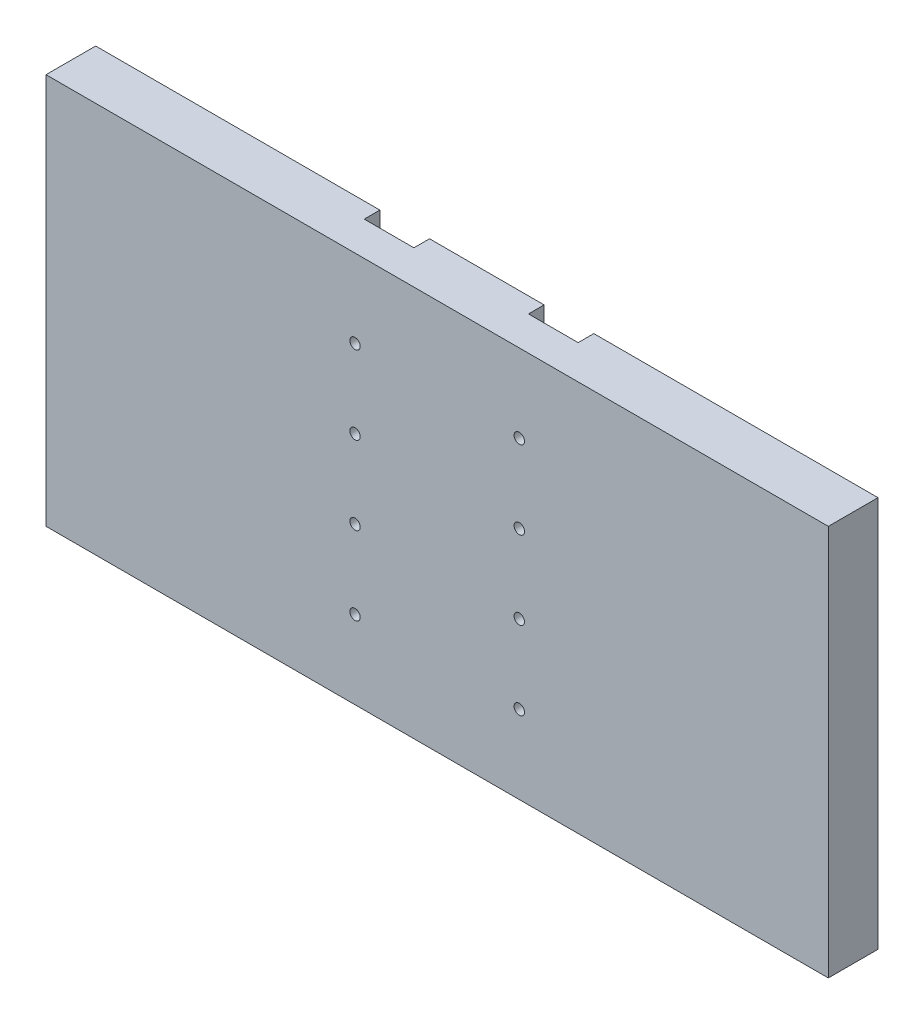
ISO-10303-21;
HEADER;
FILE_DESCRIPTION(('STEP AP214'),'2;1');
FILE_NAME('part.step','',(''),(''),'','','');
FILE_SCHEMA(('AUTOMOTIVE_DESIGN { 1 0 10303 214 1 1 1 1 }'));
ENDSEC;
DATA;
#1=APPLICATION_CONTEXT('core data for automotive mechanical design processes');
#2=APPLICATION_PROTOCOL_DEFINITION('international standard','automotive_design',2000,#1);
#3=PRODUCT_CONTEXT('',#1,'mechanical');
#4=PRODUCT('Part','Part','',(#3));
#5=PRODUCT_RELATED_PRODUCT_CATEGORY('part','',(#4));
#6=PRODUCT_DEFINITION_FORMATION('','',#4);
#7=PRODUCT_DEFINITION_CONTEXT('part definition',#1,'design');
#8=PRODUCT_DEFINITION('design','',#6,#7);
#9=PRODUCT_DEFINITION_SHAPE('','',#8);
#10=(LENGTH_UNIT() NAMED_UNIT(*) SI_UNIT(.MILLI.,.METRE.));
#11=(NAMED_UNIT(*) PLANE_ANGLE_UNIT() SI_UNIT($,.RADIAN.));
#12=(NAMED_UNIT(*) SI_UNIT($,.STERADIAN.) SOLID_ANGLE_UNIT());
#13=UNCERTAINTY_MEASURE_WITH_UNIT(LENGTH_MEASURE(1.E-05),#10,'distance_accuracy_value','');
#14=(GEOMETRIC_REPRESENTATION_CONTEXT(3) GLOBAL_UNCERTAINTY_ASSIGNED_CONTEXT((#13)) GLOBAL_UNIT_ASSIGNED_CONTEXT((#10,
#11,#12)) REPRESENTATION_CONTEXT('',''));
#15=CARTESIAN_POINT('',(0.,0.,0.));
#16=DIRECTION('',(0.,0.,1.));
#17=DIRECTION('',(1.,0.,0.));
#18=AXIS2_PLACEMENT_3D('',#15,#16,#17);
#19=CARTESIAN_POINT('',(0.,150.,0.));
#20=DIRECTION('',(0.,0.,-1.));
#21=DIRECTION('',(-1.,0.,0.));
#22=AXIS2_PLACEMENT_3D('',#19,#20,#21);
#23=PLANE('',#22);
#24=DIRECTION('',(1.,0.,0.));
#25=VECTOR('',#24,1.);
#26=CARTESIAN_POINT('',(0.,150.,0.));
#27=LINE('',#26,#25);
#28=CARTESIAN_POINT('',(0.,150.,0.));
#29=VERTEX_POINT('',#28);
#30=CARTESIAN_POINT('',(108.979,150.,0.));
#31=VERTEX_POINT('',#30);
#32=EDGE_CURVE('E190',#29,#31,#27,.T.);
#33=ORIENTED_EDGE('',*,*,#32,.T.);
#34=DIRECTION('',(0.,-1.,0.));
#35=VECTOR('',#34,1.);
#36=CARTESIAN_POINT('',(108.979,-186.029328320128,0.));
#37=LINE('',#36,#35);
#38=CARTESIAN_POINT('',(108.979,0.,0.));
#39=VERTEX_POINT('',#38);
#40=EDGE_CURVE('E212',#31,#39,#37,.T.);
#41=ORIENTED_EDGE('',*,*,#40,.T.);
#42=DIRECTION('',(1.,0.,0.));
#43=VECTOR('',#42,1.);
#44=CARTESIAN_POINT('',(0.,0.,0.));
#45=LINE('',#44,#43);
#46=CARTESIAN_POINT('',(0.,0.,0.));
#47=VERTEX_POINT('',#46);
#48=EDGE_CURVE('E142',#47,#39,#45,.T.);
#49=ORIENTED_EDGE('',*,*,#48,.F.);
#50=DIRECTION('',(0.,1.,0.));
#51=VECTOR('',#50,1.);
#52=CARTESIAN_POINT('',(0.,0.,0.));
#53=LINE('',#52,#51);
#54=EDGE_CURVE('E176',#47,#29,#53,.T.);
#55=ORIENTED_EDGE('',*,*,#54,.T.);
#56=EDGE_LOOP('',(#33,#41,#49,#55));
#57=FACE_BOUND('',#56,.T.);
#58=ADVANCED_FACE('F33',(#57),#23,.T.);
#59=CARTESIAN_POINT('',(0.,0.,19.05));
#60=DIRECTION('',(0.,1.,0.));
#61=DIRECTION('',(-1.,0.,0.));
#62=AXIS2_PLACEMENT_3D('',#59,#60,#61);
#63=PLANE('',#62);
#64=DIRECTION('',(0.,0.,-1.));
#65=VECTOR('',#64,1.);
#66=CARTESIAN_POINT('',(108.979,0.,6.));
#67=LINE('',#66,#65);
#68=CARTESIAN_POINT('',(108.979,0.,6.));
#69=VERTEX_POINT('',#68);
#70=EDGE_CURVE('E125',#69,#39,#67,.T.);
#71=ORIENTED_EDGE('',*,*,#70,.F.);
#72=DIRECTION('',(1.,0.,0.));
#73=VECTOR('',#72,1.);
#74=CARTESIAN_POINT('',(150.,0.,6.));
#75=LINE('',#74,#73);
#76=CARTESIAN_POINT('',(128.029,0.,6.));
#77=VERTEX_POINT('',#76);
#78=EDGE_CURVE('E130',#69,#77,#75,.T.);
#79=ORIENTED_EDGE('',*,*,#78,.T.);
#80=DIRECTION('',(0.,0.,-1.));
#81=VECTOR('',#80,1.);
#82=CARTESIAN_POINT('',(128.029,0.,6.));
#83=LINE('',#82,#81);
#84=CARTESIAN_POINT('',(128.029,0.,0.));
#85=VERTEX_POINT('',#84);
#86=EDGE_CURVE('E143',#77,#85,#83,.T.);
#87=ORIENTED_EDGE('',*,*,#86,.T.);
#88=CARTESIAN_POINT('',(171.971,0.,0.));
#89=VERTEX_POINT('',#88);
#90=EDGE_CURVE('E58',#85,#89,#45,.T.);
#91=ORIENTED_EDGE('',*,*,#90,.T.);
#92=DIRECTION('',(0.,0.,-1.));
#93=VECTOR('',#92,1.);
#94=CARTESIAN_POINT('',(171.971,0.,6.));
#95=LINE('',#94,#93);
#96=CARTESIAN_POINT('',(171.971,0.,6.));
#97=VERTEX_POINT('',#96);
#98=EDGE_CURVE('E169',#97,#89,#95,.T.);
#99=ORIENTED_EDGE('',*,*,#98,.F.);
#100=DIRECTION('',(1.,0.,0.));
#101=VECTOR('',#100,1.);
#102=CARTESIAN_POINT('',(150.,0.,6.));
#103=LINE('',#102,#101);
#104=CARTESIAN_POINT('',(191.021,0.,6.));
#105=VERTEX_POINT('',#104);
#106=EDGE_CURVE('E160',#97,#105,#103,.T.);
#107=ORIENTED_EDGE('',*,*,#106,.T.);
#108=DIRECTION('',(0.,0.,-1.));
#109=VECTOR('',#108,1.);
#110=CARTESIAN_POINT('',(191.021,0.,6.));
#111=LINE('',#110,#109);
#112=CARTESIAN_POINT('',(191.021,0.,0.));
#113=VERTEX_POINT('',#112);
#114=EDGE_CURVE('E163',#105,#113,#111,.T.);
#115=ORIENTED_EDGE('',*,*,#114,.T.);
#116=CARTESIAN_POINT('',(300.,0.,0.));
#117=VERTEX_POINT('',#116);
#118=EDGE_CURVE('E197',#113,#117,#45,.T.);
#119=ORIENTED_EDGE('',*,*,#118,.T.);
#120=DIRECTION('',(0.,0.,-1.));
#121=VECTOR('',#120,1.);
#122=CARTESIAN_POINT('',(300.,0.,19.05));
#123=LINE('',#122,#121);
#124=CARTESIAN_POINT('',(300.,0.,19.05));
#125=VERTEX_POINT('',#124);
#126=EDGE_CURVE('E42',#125,#117,#123,.T.);
#127=ORIENTED_EDGE('',*,*,#126,.F.);
#128=DIRECTION('',(1.,0.,0.));
#129=VECTOR('',#128,1.);
#130=CARTESIAN_POINT('',(0.,0.,19.05));
#131=LINE('',#130,#129);
#132=CARTESIAN_POINT('',(0.,0.,19.05));
#133=VERTEX_POINT('',#132);
#134=EDGE_CURVE('E185',#133,#125,#131,.T.);
#135=ORIENTED_EDGE('',*,*,#134,.F.);
#136=DIRECTION('',(0.,0.,-1.));
#137=VECTOR('',#136,1.);
#138=CARTESIAN_POINT('',(0.,0.,19.05));
#139=LINE('',#138,#137);
#140=EDGE_CURVE('E11',#133,#47,#139,.T.);
#141=ORIENTED_EDGE('',*,*,#140,.T.);
#142=ORIENTED_EDGE('',*,*,#48,.T.);
#143=EDGE_LOOP('',(#71,#79,#87,#91,#99,#107,#115,#119,#127,#135,#141,#142));
#144=FACE_BOUND('',#143,.T.);
#145=ADVANCED_FACE('F140',(#144),#63,.F.);
#146=CARTESIAN_POINT('',(0.,150.,19.05));
#147=DIRECTION('',(0.,1.,0.));
#148=DIRECTION('',(-1.,0.,0.));
#149=AXIS2_PLACEMENT_3D('',#146,#147,#148);
#150=PLANE('',#149);
#151=DIRECTION('',(1.,0.,0.));
#152=VECTOR('',#151,1.);
#153=CARTESIAN_POINT('',(150.,150.,6.));
#154=LINE('',#153,#152);
#155=CARTESIAN_POINT('',(108.979,150.,6.));
#156=VERTEX_POINT('',#155);
#157=CARTESIAN_POINT('',(128.029,150.,6.));
#158=VERTEX_POINT('',#157);
#159=EDGE_CURVE('E131',#156,#158,#154,.T.);
#160=ORIENTED_EDGE('',*,*,#159,.F.);
#161=DIRECTION('',(0.,0.,-1.));
#162=VECTOR('',#161,1.);
#163=CARTESIAN_POINT('',(108.979,150.,6.));
#164=LINE('',#163,#162);
#165=EDGE_CURVE('E128',#156,#31,#164,.T.);
#166=ORIENTED_EDGE('',*,*,#165,.T.);
#167=ORIENTED_EDGE('',*,*,#32,.F.);
#168=DIRECTION('',(0.,0.,-1.));
#169=VECTOR('',#168,1.);
#170=CARTESIAN_POINT('',(0.,150.,19.05));
#171=LINE('',#170,#169);
#172=CARTESIAN_POINT('',(0.,150.,19.05));
#173=VERTEX_POINT('',#172);
#174=EDGE_CURVE('E37',#173,#29,#171,.T.);
#175=ORIENTED_EDGE('',*,*,#174,.F.);
#176=DIRECTION('',(1.,0.,0.));
#177=VECTOR('',#176,1.);
#178=CARTESIAN_POINT('',(0.,150.,19.05));
#179=LINE('',#178,#177);
#180=CARTESIAN_POINT('',(300.,150.,19.05));
#181=VERTEX_POINT('',#180);
#182=EDGE_CURVE('E180',#173,#181,#179,.T.);
#183=ORIENTED_EDGE('',*,*,#182,.T.);
#184=DIRECTION('',(0.,0.,-1.));
#185=VECTOR('',#184,1.);
#186=CARTESIAN_POINT('',(300.,150.,19.05));
#187=LINE('',#186,#185);
#188=CARTESIAN_POINT('',(300.,150.,0.));
#189=VERTEX_POINT('',#188);
#190=EDGE_CURVE('E200',#181,#189,#187,.T.);
#191=ORIENTED_EDGE('',*,*,#190,.T.);
#192=CARTESIAN_POINT('',(191.021,150.,0.));
#193=VERTEX_POINT('',#192);
#194=EDGE_CURVE('E189',#193,#189,#27,.T.);
#195=ORIENTED_EDGE('',*,*,#194,.F.);
#196=DIRECTION('',(0.,0.,-1.));
#197=VECTOR('',#196,1.);
#198=CARTESIAN_POINT('',(191.021,150.,6.));
#199=LINE('',#198,#197);
#200=CARTESIAN_POINT('',(191.021,150.,6.));
#201=VERTEX_POINT('',#200);
#202=EDGE_CURVE('E174',#201,#193,#199,.T.);
#203=ORIENTED_EDGE('',*,*,#202,.F.);
#204=DIRECTION('',(1.,0.,0.));
#205=VECTOR('',#204,1.);
#206=CARTESIAN_POINT('',(150.,150.,6.));
#207=LINE('',#206,#205);
#208=CARTESIAN_POINT('',(171.971,150.,6.));
#209=VERTEX_POINT('',#208);
#210=EDGE_CURVE('E154',#209,#201,#207,.T.);
#211=ORIENTED_EDGE('',*,*,#210,.F.);
#212=DIRECTION('',(0.,0.,-1.));
#213=VECTOR('',#212,1.);
#214=CARTESIAN_POINT('',(171.971,150.,6.));
#215=LINE('',#214,#213);
#216=CARTESIAN_POINT('',(171.971,150.,0.));
#217=VERTEX_POINT('',#216);
#218=EDGE_CURVE('E171',#209,#217,#215,.T.);
#219=ORIENTED_EDGE('',*,*,#218,.T.);
#220=CARTESIAN_POINT('',(128.029,150.,0.));
#221=VERTEX_POINT('',#220);
#222=EDGE_CURVE('E194',#221,#217,#27,.T.);
#223=ORIENTED_EDGE('',*,*,#222,.F.);
#224=DIRECTION('',(0.,0.,-1.));
#225=VECTOR('',#224,1.);
#226=CARTESIAN_POINT('',(128.029,150.,6.));
#227=LINE('',#226,#225);
#228=EDGE_CURVE('E147',#158,#221,#227,.T.);
#229=ORIENTED_EDGE('',*,*,#228,.F.);
#230=EDGE_LOOP('',(#160,#166,#167,#175,#183,#191,#195,#203,#211,#219,#223,#229));
#231=FACE_BOUND('',#230,.T.);
#232=ADVANCED_FACE('F210',(#231),#150,.T.);
#233=DIRECTION('',(0.,-1.,0.));
#234=VECTOR('',#233,1.);
#235=CARTESIAN_POINT('',(128.029,-186.029328320128,0.));
#236=LINE('',#235,#234);
#237=EDGE_CURVE('E213',#221,#85,#236,.T.);
#238=ORIENTED_EDGE('',*,*,#237,.F.);
#239=ORIENTED_EDGE('',*,*,#222,.T.);
#240=DIRECTION('',(0.,-1.,0.));
#241=VECTOR('',#240,1.);
#242=CARTESIAN_POINT('',(171.971,-186.029328320128,0.));
#243=LINE('',#242,#241);
#244=EDGE_CURVE('E155',#217,#89,#243,.T.);
#245=ORIENTED_EDGE('',*,*,#244,.T.);
#246=ORIENTED_EDGE('',*,*,#90,.F.);
#247=EDGE_LOOP('',(#238,#239,#245,#246));
#248=FACE_BOUND('',#247,.T.);
#249=ADVANCED_FACE('F227',(#248),#23,.T.);
#250=CARTESIAN_POINT('',(0.,0.,19.05));
#251=DIRECTION('',(-1.,0.,0.));
#252=DIRECTION('',(0.,0.,1.));
#253=AXIS2_PLACEMENT_3D('',#250,#251,#252);
#254=PLANE('',#253);
#255=ORIENTED_EDGE('',*,*,#54,.F.);
#256=ORIENTED_EDGE('',*,*,#140,.F.);
#257=DIRECTION('',(0.,1.,0.));
#258=VECTOR('',#257,1.);
#259=CARTESIAN_POINT('',(0.,0.,19.05));
#260=LINE('',#259,#258);
#261=EDGE_CURVE('E177',#133,#173,#260,.T.);
#262=ORIENTED_EDGE('',*,*,#261,.T.);
#263=ORIENTED_EDGE('',*,*,#174,.T.);
#264=EDGE_LOOP('',(#255,#256,#262,#263));
#265=FACE_BOUND('',#264,.T.);
#266=ADVANCED_FACE('F35',(#265),#254,.T.);
#267=CARTESIAN_POINT('',(300.,0.,19.05));
#268=DIRECTION('',(-1.,0.,0.));
#269=DIRECTION('',(0.,-1.,0.));
#270=AXIS2_PLACEMENT_3D('',#267,#268,#269);
#271=PLANE('',#270);
#272=DIRECTION('',(0.,1.,0.));
#273=VECTOR('',#272,1.);
#274=CARTESIAN_POINT('',(300.,0.,0.));
#275=LINE('',#274,#273);
#276=EDGE_CURVE('E193',#117,#189,#275,.T.);
#277=ORIENTED_EDGE('',*,*,#276,.T.);
#278=ORIENTED_EDGE('',*,*,#190,.F.);
#279=DIRECTION('',(0.,1.,0.));
#280=VECTOR('',#279,1.);
#281=CARTESIAN_POINT('',(300.,0.,19.05));
#282=LINE('',#281,#280);
#283=EDGE_CURVE('E183',#125,#181,#282,.T.);
#284=ORIENTED_EDGE('',*,*,#283,.F.);
#285=ORIENTED_EDGE('',*,*,#126,.T.);
#286=EDGE_LOOP('',(#277,#278,#284,#285));
#287=FACE_BOUND('',#286,.T.);
#288=ADVANCED_FACE('F248',(#287),#271,.F.);
#289=CARTESIAN_POINT('',(0.,150.,19.05));
#290=DIRECTION('',(0.,0.,-1.));
#291=DIRECTION('',(-1.,0.,0.));
#292=AXIS2_PLACEMENT_3D('',#289,#290,#291);
#293=PLANE('',#292);
#294=CARTESIAN_POINT('',(118.504,120.,19.05));
#295=DIRECTION('',(0.,0.,-1.));
#296=DIRECTION('',(1.,0.,0.));
#297=AXIS2_PLACEMENT_3D('',#294,#295,#296);
#298=CIRCLE('',#297,2.);
#299=CARTESIAN_POINT('',(120.504,120.,19.05));
#300=VERTEX_POINT('',#299);
#301=EDGE_CURVE('E489',#300,#300,#298,.T.);
#302=ORIENTED_EDGE('',*,*,#301,.T.);
#303=EDGE_LOOP('',(#302));
#304=FACE_BOUND('',#303,.T.);
#305=CARTESIAN_POINT('',(118.504,90.,19.05));
#306=DIRECTION('',(0.,0.,-1.));
#307=DIRECTION('',(1.,0.,0.));
#308=AXIS2_PLACEMENT_3D('',#305,#306,#307);
#309=CIRCLE('',#308,2.);
#310=CARTESIAN_POINT('',(120.504,90.,19.05));
#311=VERTEX_POINT('',#310);
#312=EDGE_CURVE('E483',#311,#311,#309,.T.);
#313=ORIENTED_EDGE('',*,*,#312,.T.);
#314=EDGE_LOOP('',(#313));
#315=FACE_BOUND('',#314,.T.);
#316=CARTESIAN_POINT('',(118.504,60.,19.05));
#317=DIRECTION('',(0.,0.,-1.));
#318=DIRECTION('',(1.,0.,0.));
#319=AXIS2_PLACEMENT_3D('',#316,#317,#318);
#320=CIRCLE('',#319,1.99999999999999);
#321=CARTESIAN_POINT('',(120.504,60.,19.05));
#322=VERTEX_POINT('',#321);
#323=EDGE_CURVE('E477',#322,#322,#320,.T.);
#324=ORIENTED_EDGE('',*,*,#323,.T.);
#325=EDGE_LOOP('',(#324));
#326=FACE_BOUND('',#325,.T.);
#327=CARTESIAN_POINT('',(118.504,30.,19.05));
#328=DIRECTION('',(0.,0.,-1.));
#329=DIRECTION('',(1.,0.,0.));
#330=AXIS2_PLACEMENT_3D('',#327,#328,#329);
#331=CIRCLE('',#330,2.);
#332=CARTESIAN_POINT('',(120.504,30.,19.05));
#333=VERTEX_POINT('',#332);
#334=EDGE_CURVE('E471',#333,#333,#331,.T.);
#335=ORIENTED_EDGE('',*,*,#334,.T.);
#336=EDGE_LOOP('',(#335));
#337=FACE_BOUND('',#336,.T.);
#338=CARTESIAN_POINT('',(181.496,120.,19.05));
#339=DIRECTION('',(0.,0.,-1.));
#340=DIRECTION('',(-1.,0.,0.));
#341=AXIS2_PLACEMENT_3D('',#338,#339,#340);
#342=CIRCLE('',#341,2.);
#343=CARTESIAN_POINT('',(179.496,120.,19.05));
#344=VERTEX_POINT('',#343);
#345=EDGE_CURVE('E467',#344,#344,#342,.T.);
#346=ORIENTED_EDGE('',*,*,#345,.T.);
#347=EDGE_LOOP('',(#346));
#348=FACE_BOUND('',#347,.T.);
#349=CARTESIAN_POINT('',(181.496,90.,19.05));
#350=DIRECTION('',(0.,0.,-1.));
#351=DIRECTION('',(-1.,0.,0.));
#352=AXIS2_PLACEMENT_3D('',#349,#350,#351);
#353=CIRCLE('',#352,2.);
#354=CARTESIAN_POINT('',(179.496,90.,19.05));
#355=VERTEX_POINT('',#354);
#356=EDGE_CURVE('E464',#355,#355,#353,.T.);
#357=ORIENTED_EDGE('',*,*,#356,.T.);
#358=EDGE_LOOP('',(#357));
#359=FACE_BOUND('',#358,.T.);
#360=CARTESIAN_POINT('',(181.496,60.,19.05));
#361=DIRECTION('',(0.,0.,-1.));
#362=DIRECTION('',(-1.,0.,0.));
#363=AXIS2_PLACEMENT_3D('',#360,#361,#362);
#364=CIRCLE('',#363,1.99999999999999);
#365=CARTESIAN_POINT('',(179.496,60.,19.05));
#366=VERTEX_POINT('',#365);
#367=EDGE_CURVE('E458',#366,#366,#364,.T.);
#368=ORIENTED_EDGE('',*,*,#367,.T.);
#369=EDGE_LOOP('',(#368));
#370=FACE_BOUND('',#369,.T.);
#371=CARTESIAN_POINT('',(181.496,30.,19.05));
#372=DIRECTION('',(0.,0.,-1.));
#373=DIRECTION('',(-1.,0.,0.));
#374=AXIS2_PLACEMENT_3D('',#371,#372,#373);
#375=CIRCLE('',#374,2.);
#376=CARTESIAN_POINT('',(179.496,30.,19.05));
#377=VERTEX_POINT('',#376);
#378=EDGE_CURVE('E214',#377,#377,#375,.T.);
#379=ORIENTED_EDGE('',*,*,#378,.T.);
#380=EDGE_LOOP('',(#379));
#381=FACE_BOUND('',#380,.T.);
#382=ORIENTED_EDGE('',*,*,#261,.F.);
#383=ORIENTED_EDGE('',*,*,#134,.T.);
#384=ORIENTED_EDGE('',*,*,#283,.T.);
#385=ORIENTED_EDGE('',*,*,#182,.F.);
#386=EDGE_LOOP('',(#382,#383,#384,#385));
#387=FACE_BOUND('',#386,.T.);
#388=ADVANCED_FACE('F250',(#304,#315,#326,#337,#348,#359,#370,#381,#387),#293,.F.);
#389=DIRECTION('',(0.,-1.,0.));
#390=VECTOR('',#389,1.);
#391=CARTESIAN_POINT('',(191.021,-186.029328320128,0.));
#392=LINE('',#391,#390);
#393=EDGE_CURVE('E145',#193,#113,#392,.T.);
#394=ORIENTED_EDGE('',*,*,#393,.F.);
#395=ORIENTED_EDGE('',*,*,#194,.T.);
#396=ORIENTED_EDGE('',*,*,#276,.F.);
#397=ORIENTED_EDGE('',*,*,#118,.F.);
#398=EDGE_LOOP('',(#394,#395,#396,#397));
#399=FACE_BOUND('',#398,.T.);
#400=ADVANCED_FACE('F233',(#399),#23,.T.);
#401=CARTESIAN_POINT('',(191.021,-186.029328320128,6.));
#402=DIRECTION('',(1.,0.,0.));
#403=DIRECTION('',(0.,1.,0.));
#404=AXIS2_PLACEMENT_3D('',#401,#402,#403);
#405=PLANE('',#404);
#406=ORIENTED_EDGE('',*,*,#393,.T.);
#407=ORIENTED_EDGE('',*,*,#114,.F.);
#408=DIRECTION('',(0.,-1.,0.));
#409=VECTOR('',#408,1.);
#410=CARTESIAN_POINT('',(191.021,-186.029328320128,6.));
#411=LINE('',#410,#409);
#412=EDGE_CURVE('E151',#201,#105,#411,.T.);
#413=ORIENTED_EDGE('',*,*,#412,.F.);
#414=ORIENTED_EDGE('',*,*,#202,.T.);
#415=EDGE_LOOP('',(#406,#407,#413,#414));
#416=FACE_BOUND('',#415,.T.);
#417=ADVANCED_FACE('F237',(#416),#405,.F.);
#418=CARTESIAN_POINT('',(171.971,-186.029328320128,6.));
#419=DIRECTION('',(1.,0.,0.));
#420=DIRECTION('',(0.,0.,-1.));
#421=AXIS2_PLACEMENT_3D('',#418,#419,#420);
#422=PLANE('',#421);
#423=ORIENTED_EDGE('',*,*,#244,.F.);
#424=ORIENTED_EDGE('',*,*,#218,.F.);
#425=DIRECTION('',(0.,-1.,0.));
#426=VECTOR('',#425,1.);
#427=CARTESIAN_POINT('',(171.971,-186.029328320128,6.));
#428=LINE('',#427,#426);
#429=EDGE_CURVE('E158',#209,#97,#428,.T.);
#430=ORIENTED_EDGE('',*,*,#429,.T.);
#431=ORIENTED_EDGE('',*,*,#98,.T.);
#432=EDGE_LOOP('',(#423,#424,#430,#431));
#433=FACE_BOUND('',#432,.T.);
#434=ADVANCED_FACE('F243',(#433),#422,.T.);
#435=CARTESIAN_POINT('',(150.,-186.029328320128,6.));
#436=DIRECTION('',(0.,0.,1.));
#437=DIRECTION('',(1.,0.,0.));
#438=AXIS2_PLACEMENT_3D('',#435,#436,#437);
#439=PLANE('',#438);
#440=CARTESIAN_POINT('',(181.496,120.,6.));
#441=DIRECTION('',(0.,0.,-1.));
#442=DIRECTION('',(-1.,0.,0.));
#443=AXIS2_PLACEMENT_3D('',#440,#441,#442);
#444=CIRCLE('',#443,2.);
#445=CARTESIAN_POINT('',(179.496,120.,6.));
#446=VERTEX_POINT('',#445);
#447=EDGE_CURVE('E446',#446,#446,#444,.T.);
#448=ORIENTED_EDGE('',*,*,#447,.F.);
#449=EDGE_LOOP('',(#448));
#450=FACE_BOUND('',#449,.T.);
#451=CARTESIAN_POINT('',(181.496,90.,6.));
#452=DIRECTION('',(0.,0.,-1.));
#453=DIRECTION('',(-1.,0.,0.));
#454=AXIS2_PLACEMENT_3D('',#451,#452,#453);
#455=CIRCLE('',#454,2.);
#456=CARTESIAN_POINT('',(179.496,90.,6.));
#457=VERTEX_POINT('',#456);
#458=EDGE_CURVE('E450',#457,#457,#455,.T.);
#459=ORIENTED_EDGE('',*,*,#458,.F.);
#460=EDGE_LOOP('',(#459));
#461=FACE_BOUND('',#460,.T.);
#462=CARTESIAN_POINT('',(181.496,60.,6.));
#463=DIRECTION('',(0.,0.,-1.));
#464=DIRECTION('',(-1.,0.,0.));
#465=AXIS2_PLACEMENT_3D('',#462,#463,#464);
#466=CIRCLE('',#465,1.99999999999999);
#467=CARTESIAN_POINT('',(179.496,60.,6.));
#468=VERTEX_POINT('',#467);
#469=EDGE_CURVE('E454',#468,#468,#466,.T.);
#470=ORIENTED_EDGE('',*,*,#469,.F.);
#471=EDGE_LOOP('',(#470));
#472=FACE_BOUND('',#471,.T.);
#473=CARTESIAN_POINT('',(181.496,30.,6.));
#474=DIRECTION('',(0.,0.,-1.));
#475=DIRECTION('',(-1.,0.,0.));
#476=AXIS2_PLACEMENT_3D('',#473,#474,#475);
#477=CIRCLE('',#476,2.);
#478=CARTESIAN_POINT('',(179.496,30.,6.));
#479=VERTEX_POINT('',#478);
#480=EDGE_CURVE('E218',#479,#479,#477,.T.);
#481=ORIENTED_EDGE('',*,*,#480,.F.);
#482=EDGE_LOOP('',(#481));
#483=FACE_BOUND('',#482,.T.);
#484=ORIENTED_EDGE('',*,*,#412,.T.);
#485=ORIENTED_EDGE('',*,*,#106,.F.);
#486=ORIENTED_EDGE('',*,*,#429,.F.);
#487=ORIENTED_EDGE('',*,*,#210,.T.);
#488=EDGE_LOOP('',(#484,#485,#486,#487));
#489=FACE_BOUND('',#488,.T.);
#490=ADVANCED_FACE('F241',(#450,#461,#472,#483,#489),#439,.F.);
#491=CARTESIAN_POINT('',(108.979,-186.029328320128,6.));
#492=DIRECTION('',(1.,0.,0.));
#493=DIRECTION('',(0.,1.,0.));
#494=AXIS2_PLACEMENT_3D('',#491,#492,#493);
#495=PLANE('',#494);
#496=ORIENTED_EDGE('',*,*,#40,.F.);
#497=ORIENTED_EDGE('',*,*,#165,.F.);
#498=DIRECTION('',(0.,-1.,0.));
#499=VECTOR('',#498,1.);
#500=CARTESIAN_POINT('',(108.979,-186.029328320128,6.));
#501=LINE('',#500,#499);
#502=EDGE_CURVE('E50',#156,#69,#501,.T.);
#503=ORIENTED_EDGE('',*,*,#502,.T.);
#504=ORIENTED_EDGE('',*,*,#70,.T.);
#505=EDGE_LOOP('',(#496,#497,#503,#504));
#506=FACE_BOUND('',#505,.T.);
#507=ADVANCED_FACE('F123',(#506),#495,.T.);
#508=CARTESIAN_POINT('',(128.029,-186.029328320128,6.));
#509=DIRECTION('',(1.,0.,0.));
#510=DIRECTION('',(0.,1.,0.));
#511=AXIS2_PLACEMENT_3D('',#508,#509,#510);
#512=PLANE('',#511);
#513=ORIENTED_EDGE('',*,*,#237,.T.);
#514=ORIENTED_EDGE('',*,*,#86,.F.);
#515=DIRECTION('',(0.,-1.,0.));
#516=VECTOR('',#515,1.);
#517=CARTESIAN_POINT('',(128.029,-186.029328320128,6.));
#518=LINE('',#517,#516);
#519=EDGE_CURVE('E137',#158,#77,#518,.T.);
#520=ORIENTED_EDGE('',*,*,#519,.F.);
#521=ORIENTED_EDGE('',*,*,#228,.T.);
#522=EDGE_LOOP('',(#513,#514,#520,#521));
#523=FACE_BOUND('',#522,.T.);
#524=ADVANCED_FACE('F224',(#523),#512,.F.);
#525=CARTESIAN_POINT('',(150.,-186.029328320128,6.));
#526=DIRECTION('',(0.,0.,1.));
#527=DIRECTION('',(1.,0.,0.));
#528=AXIS2_PLACEMENT_3D('',#525,#526,#527);
#529=PLANE('',#528);
#530=CARTESIAN_POINT('',(118.504,120.,6.));
#531=DIRECTION('',(0.,0.,-1.));
#532=DIRECTION('',(1.,0.,0.));
#533=AXIS2_PLACEMENT_3D('',#530,#531,#532);
#534=CIRCLE('',#533,2.);
#535=CARTESIAN_POINT('',(120.504,120.,6.));
#536=VERTEX_POINT('',#535);
#537=EDGE_CURVE('E492',#536,#536,#534,.T.);
#538=ORIENTED_EDGE('',*,*,#537,.F.);
#539=EDGE_LOOP('',(#538));
#540=FACE_BOUND('',#539,.T.);
#541=CARTESIAN_POINT('',(118.504,90.,6.));
#542=DIRECTION('',(0.,0.,-1.));
#543=DIRECTION('',(1.,0.,0.));
#544=AXIS2_PLACEMENT_3D('',#541,#542,#543);
#545=CIRCLE('',#544,2.);
#546=CARTESIAN_POINT('',(120.504,90.,6.));
#547=VERTEX_POINT('',#546);
#548=EDGE_CURVE('E486',#547,#547,#545,.T.);
#549=ORIENTED_EDGE('',*,*,#548,.F.);
#550=EDGE_LOOP('',(#549));
#551=FACE_BOUND('',#550,.T.);
#552=CARTESIAN_POINT('',(118.504,60.,6.));
#553=DIRECTION('',(0.,0.,-1.));
#554=DIRECTION('',(1.,0.,0.));
#555=AXIS2_PLACEMENT_3D('',#552,#553,#554);
#556=CIRCLE('',#555,1.99999999999999);
#557=CARTESIAN_POINT('',(120.504,60.,6.));
#558=VERTEX_POINT('',#557);
#559=EDGE_CURVE('E480',#558,#558,#556,.T.);
#560=ORIENTED_EDGE('',*,*,#559,.F.);
#561=EDGE_LOOP('',(#560));
#562=FACE_BOUND('',#561,.T.);
#563=CARTESIAN_POINT('',(118.504,30.,6.));
#564=DIRECTION('',(0.,0.,-1.));
#565=DIRECTION('',(1.,0.,0.));
#566=AXIS2_PLACEMENT_3D('',#563,#564,#565);
#567=CIRCLE('',#566,2.);
#568=CARTESIAN_POINT('',(120.504,30.,6.));
#569=VERTEX_POINT('',#568);
#570=EDGE_CURVE('E474',#569,#569,#567,.T.);
#571=ORIENTED_EDGE('',*,*,#570,.F.);
#572=EDGE_LOOP('',(#571));
#573=FACE_BOUND('',#572,.T.);
#574=ORIENTED_EDGE('',*,*,#159,.T.);
#575=ORIENTED_EDGE('',*,*,#519,.T.);
#576=ORIENTED_EDGE('',*,*,#78,.F.);
#577=ORIENTED_EDGE('',*,*,#502,.F.);
#578=EDGE_LOOP('',(#574,#575,#576,#577));
#579=FACE_BOUND('',#578,.T.);
#580=ADVANCED_FACE('F135',(#540,#551,#562,#573,#579),#529,.F.);
#581=CARTESIAN_POINT('',(181.496,30.,19.05));
#582=DIRECTION('',(0.,0.,-1.));
#583=DIRECTION('',(-1.,0.,0.));
#584=AXIS2_PLACEMENT_3D('',#581,#582,#583);
#585=CYLINDRICAL_SURFACE('',#584,2.);
#586=ORIENTED_EDGE('',*,*,#378,.F.);
#587=EDGE_LOOP('',(#586));
#588=FACE_BOUND('',#587,.T.);
#589=ORIENTED_EDGE('',*,*,#480,.T.);
#590=EDGE_LOOP('',(#589));
#591=FACE_BOUND('',#590,.T.);
#592=ADVANCED_FACE('F354',(#588,#591),#585,.F.);
#593=CARTESIAN_POINT('',(181.496,60.,19.05));
#594=DIRECTION('',(0.,0.,-1.));
#595=DIRECTION('',(-1.,0.,0.));
#596=AXIS2_PLACEMENT_3D('',#593,#594,#595);
#597=CYLINDRICAL_SURFACE('',#596,1.99999999999999);
#598=ORIENTED_EDGE('',*,*,#367,.F.);
#599=EDGE_LOOP('',(#598));
#600=FACE_BOUND('',#599,.T.);
#601=ORIENTED_EDGE('',*,*,#469,.T.);
#602=EDGE_LOOP('',(#601));
#603=FACE_BOUND('',#602,.T.);
#604=ADVANCED_FACE('F361',(#600,#603),#597,.F.);
#605=CARTESIAN_POINT('',(181.496,90.,19.05));
#606=DIRECTION('',(0.,0.,-1.));
#607=DIRECTION('',(-1.,0.,0.));
#608=AXIS2_PLACEMENT_3D('',#605,#606,#607);
#609=CYLINDRICAL_SURFACE('',#608,2.);
#610=ORIENTED_EDGE('',*,*,#356,.F.);
#611=EDGE_LOOP('',(#610));
#612=FACE_BOUND('',#611,.T.);
#613=ORIENTED_EDGE('',*,*,#458,.T.);
#614=EDGE_LOOP('',(#613));
#615=FACE_BOUND('',#614,.T.);
#616=ADVANCED_FACE('F369',(#612,#615),#609,.F.);
#617=CARTESIAN_POINT('',(181.496,120.,19.05));
#618=DIRECTION('',(0.,0.,-1.));
#619=DIRECTION('',(-1.,0.,0.));
#620=AXIS2_PLACEMENT_3D('',#617,#618,#619);
#621=CYLINDRICAL_SURFACE('',#620,2.);
#622=ORIENTED_EDGE('',*,*,#345,.F.);
#623=EDGE_LOOP('',(#622));
#624=FACE_BOUND('',#623,.T.);
#625=ORIENTED_EDGE('',*,*,#447,.T.);
#626=EDGE_LOOP('',(#625));
#627=FACE_BOUND('',#626,.T.);
#628=ADVANCED_FACE('F377',(#624,#627),#621,.F.);
#629=CARTESIAN_POINT('',(118.504,30.,19.05));
#630=DIRECTION('',(0.,0.,-1.));
#631=DIRECTION('',(-1.,0.,0.));
#632=AXIS2_PLACEMENT_3D('',#629,#630,#631);
#633=CYLINDRICAL_SURFACE('',#632,2.);
#634=ORIENTED_EDGE('',*,*,#334,.F.);
#635=EDGE_LOOP('',(#634));
#636=FACE_BOUND('',#635,.T.);
#637=ORIENTED_EDGE('',*,*,#570,.T.);
#638=EDGE_LOOP('',(#637));
#639=FACE_BOUND('',#638,.T.);
#640=ADVANCED_FACE('F385',(#636,#639),#633,.F.);
#641=CARTESIAN_POINT('',(118.504,60.,19.05));
#642=DIRECTION('',(0.,0.,-1.));
#643=DIRECTION('',(-1.,0.,0.));
#644=AXIS2_PLACEMENT_3D('',#641,#642,#643);
#645=CYLINDRICAL_SURFACE('',#644,1.99999999999999);
#646=ORIENTED_EDGE('',*,*,#323,.F.);
#647=EDGE_LOOP('',(#646));
#648=FACE_BOUND('',#647,.T.);
#649=ORIENTED_EDGE('',*,*,#559,.T.);
#650=EDGE_LOOP('',(#649));
#651=FACE_BOUND('',#650,.T.);
#652=ADVANCED_FACE('F393',(#648,#651),#645,.F.);
#653=CARTESIAN_POINT('',(118.504,90.,19.05));
#654=DIRECTION('',(0.,0.,-1.));
#655=DIRECTION('',(-1.,0.,0.));
#656=AXIS2_PLACEMENT_3D('',#653,#654,#655);
#657=CYLINDRICAL_SURFACE('',#656,2.);
#658=ORIENTED_EDGE('',*,*,#312,.F.);
#659=EDGE_LOOP('',(#658));
#660=FACE_BOUND('',#659,.T.);
#661=ORIENTED_EDGE('',*,*,#548,.T.);
#662=EDGE_LOOP('',(#661));
#663=FACE_BOUND('',#662,.T.);
#664=ADVANCED_FACE('F401',(#660,#663),#657,.F.);
#665=CARTESIAN_POINT('',(118.504,120.,19.05));
#666=DIRECTION('',(0.,0.,-1.));
#667=DIRECTION('',(-1.,0.,0.));
#668=AXIS2_PLACEMENT_3D('',#665,#666,#667);
#669=CYLINDRICAL_SURFACE('',#668,2.);
#670=ORIENTED_EDGE('',*,*,#301,.F.);
#671=EDGE_LOOP('',(#670));
#672=FACE_BOUND('',#671,.T.);
#673=ORIENTED_EDGE('',*,*,#537,.T.);
#674=EDGE_LOOP('',(#673));
#675=FACE_BOUND('',#674,.T.);
#676=ADVANCED_FACE('F409',(#672,#675),#669,.F.);
#677=CLOSED_SHELL('',(#58,#145,#232,#249,#266,#288,#388,#400,#417,#434,#490,#507,#524,#580,#592,
#604,#616,#628,#640,#652,#664,#676));
#678=MANIFOLD_SOLID_BREP('B2',#677);
#679=ADVANCED_BREP_SHAPE_REPRESENTATION('',(#18,#678),#14);
#680=SHAPE_DEFINITION_REPRESENTATION(#9,#679);
ENDSEC;
END-ISO-10303-21;
